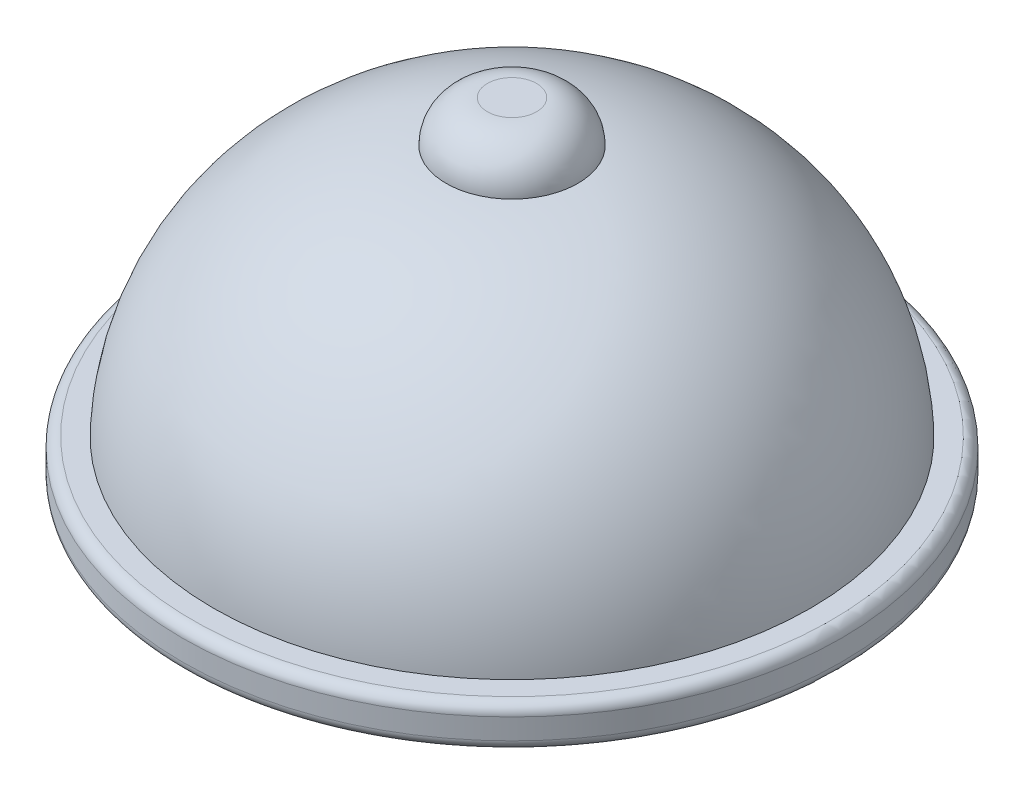
ISO-10303-21;
HEADER;
FILE_DESCRIPTION(('STEP AP214'),'2;1');
FILE_NAME('part.step','',(''),(''),'','','');
FILE_SCHEMA(('AUTOMOTIVE_DESIGN { 1 0 10303 214 1 1 1 1 }'));
ENDSEC;
DATA;
#1=APPLICATION_CONTEXT('core data for automotive mechanical design processes');
#2=APPLICATION_PROTOCOL_DEFINITION('international standard','automotive_design',2000,#1);
#3=PRODUCT_CONTEXT('',#1,'mechanical');
#4=PRODUCT('Part','Part','',(#3));
#5=PRODUCT_RELATED_PRODUCT_CATEGORY('part','',(#4));
#6=PRODUCT_DEFINITION_FORMATION('','',#4);
#7=PRODUCT_DEFINITION_CONTEXT('part definition',#1,'design');
#8=PRODUCT_DEFINITION('design','',#6,#7);
#9=PRODUCT_DEFINITION_SHAPE('','',#8);
#10=(LENGTH_UNIT() NAMED_UNIT(*) SI_UNIT(.MILLI.,.METRE.));
#11=(NAMED_UNIT(*) PLANE_ANGLE_UNIT() SI_UNIT($,.RADIAN.));
#12=(NAMED_UNIT(*) SI_UNIT($,.STERADIAN.) SOLID_ANGLE_UNIT());
#13=UNCERTAINTY_MEASURE_WITH_UNIT(LENGTH_MEASURE(1.E-05),#10,'distance_accuracy_value','');
#14=(GEOMETRIC_REPRESENTATION_CONTEXT(3) GLOBAL_UNCERTAINTY_ASSIGNED_CONTEXT((#13)) GLOBAL_UNIT_ASSIGNED_CONTEXT((#10,
#11,#12)) REPRESENTATION_CONTEXT('',''));
#15=CARTESIAN_POINT('',(0.,0.,0.));
#16=DIRECTION('',(0.,0.,1.));
#17=DIRECTION('',(1.,0.,0.));
#18=AXIS2_PLACEMENT_3D('',#15,#16,#17);
#19=CARTESIAN_POINT('',(0.,44.2057902372174,0.));
#20=DIRECTION('',(0.,-1.,0.));
#21=DIRECTION('',(0.,0.,-1.));
#22=AXIS2_PLACEMENT_3D('',#19,#20,#21);
#23=PLANE('',#22);
#24=CARTESIAN_POINT('',(0.,44.2057902372174,0.));
#25=DIRECTION('',(0.,-1.,0.));
#26=DIRECTION('',(0.,0.,-1.));
#27=AXIS2_PLACEMENT_3D('',#24,#25,#26);
#28=CIRCLE('',#27,15.0893742438228);
#29=CARTESIAN_POINT('',(0.,44.2057902372174,-15.0893742438228));
#30=VERTEX_POINT('',#29);
#31=EDGE_CURVE('E10',#30,#30,#28,.T.);
#32=ORIENTED_EDGE('',*,*,#31,.F.);
#33=EDGE_LOOP('',(#32));
#34=FACE_BOUND('',#33,.T.);
#35=ADVANCED_FACE('F33',(#34),#23,.F.);
#36=CARTESIAN_POINT('',(0.,18.8057902372174,0.));
#37=DIRECTION('',(0.,-1.,0.));
#38=DIRECTION('',(0.,0.,-1.));
#39=AXIS2_PLACEMENT_3D('',#36,#37,#38);
#40=DEGENERATE_TOROIDAL_SURFACE('',#39,15.089374243823,25.4,.T.);
#41=CARTESIAN_POINT('',(0.,18.8057902372172,0.));
#42=DIRECTION('',(0.,-1.,0.));
#43=DIRECTION('',(0.,0.,-1.));
#44=AXIS2_PLACEMENT_3D('',#41,#42,#43);
#45=CIRCLE('',#44,40.489374243823);
#46=CARTESIAN_POINT('',(0.,18.8057902372172,-40.489374243823));
#47=VERTEX_POINT('',#46);
#48=EDGE_CURVE('E39',#47,#47,#45,.T.);
#49=ORIENTED_EDGE('',*,*,#48,.F.);
#50=EDGE_LOOP('',(#49));
#51=FACE_BOUND('',#50,.T.);
#52=ORIENTED_EDGE('',*,*,#31,.T.);
#53=EDGE_LOOP('',(#52));
#54=FACE_BOUND('',#53,.T.);
#55=ADVANCED_FACE('F126',(#51,#54),#40,.T.);
#56=CARTESIAN_POINT('',(0.,-142.850949297738,0.));
#57=DIRECTION('',(0.,-1.,0.));
#58=DIRECTION('',(0.,0.,-1.));
#59=AXIS2_PLACEMENT_3D('',#56,#57,#58);
#60=DEGENERATE_TOROIDAL_SURFACE('',#59,20.5699164867785,162.879360983542,.T.);
#61=CARTESIAN_POINT('',(0.,-135.811771560023,0.));
#62=DIRECTION('',(0.,-1.,0.));
#63=DIRECTION('',(0.,0.,-1.));
#64=AXIS2_PLACEMENT_3D('',#61,#62,#63);
#65=CIRCLE('',#64,183.297099867994);
#66=CARTESIAN_POINT('',(0.,-135.811771560023,-183.297099867994));
#67=VERTEX_POINT('',#66);
#68=EDGE_CURVE('E43',#67,#67,#65,.T.);
#69=ORIENTED_EDGE('',*,*,#68,.F.);
#70=EDGE_LOOP('',(#69));
#71=FACE_BOUND('',#70,.T.);
#72=ORIENTED_EDGE('',*,*,#48,.T.);
#73=EDGE_LOOP('',(#72));
#74=FACE_BOUND('',#73,.T.);
#75=ADVANCED_FACE('F121',(#71,#74),#60,.T.);
#76=CARTESIAN_POINT('',(-183.297099867994,-135.811771560023,0.));
#77=DIRECTION('',(0.,-1.,0.));
#78=DIRECTION('',(0.,0.,-1.));
#79=AXIS2_PLACEMENT_3D('',#76,#77,#78);
#80=PLANE('',#79);
#81=CARTESIAN_POINT('',(0.,-135.811771560023,0.));
#82=DIRECTION('',(0.,-1.,0.));
#83=DIRECTION('',(0.,0.,-1.));
#84=AXIS2_PLACEMENT_3D('',#81,#82,#83);
#85=CIRCLE('',#84,196.040553668275);
#86=CARTESIAN_POINT('',(0.,-135.811771560023,-196.040553668275));
#87=VERTEX_POINT('',#86);
#88=EDGE_CURVE('E47',#87,#87,#85,.T.);
#89=ORIENTED_EDGE('',*,*,#88,.F.);
#90=EDGE_LOOP('',(#89));
#91=FACE_BOUND('',#90,.T.);
#92=ORIENTED_EDGE('',*,*,#68,.T.);
#93=EDGE_LOOP('',(#92));
#94=FACE_BOUND('',#93,.T.);
#95=ADVANCED_FACE('F115',(#91,#94),#80,.F.);
#96=CARTESIAN_POINT('',(0.,-142.161771560023,0.));
#97=DIRECTION('',(0.,-1.,0.));
#98=DIRECTION('',(0.,0.,-1.));
#99=AXIS2_PLACEMENT_3D('',#96,#97,#98);
#100=TOROIDAL_SURFACE('',#99,196.040553668275,6.34999999999999);
#101=CARTESIAN_POINT('',(0.,-142.161771560023,0.));
#102=DIRECTION('',(0.,-1.,0.));
#103=DIRECTION('',(0.,0.,-1.));
#104=AXIS2_PLACEMENT_3D('',#101,#102,#103);
#105=CIRCLE('',#104,202.390553668275);
#106=CARTESIAN_POINT('',(0.,-142.161771560023,-202.390553668275));
#107=VERTEX_POINT('',#106);
#108=EDGE_CURVE('E52',#107,#107,#105,.T.);
#109=ORIENTED_EDGE('',*,*,#108,.F.);
#110=EDGE_LOOP('',(#109));
#111=FACE_BOUND('',#110,.T.);
#112=ORIENTED_EDGE('',*,*,#88,.T.);
#113=EDGE_LOOP('',(#112));
#114=FACE_BOUND('',#113,.T.);
#115=ADVANCED_FACE('F109',(#111,#114),#100,.T.);
#116=CARTESIAN_POINT('',(0.,0.,0.));
#117=DIRECTION('',(0.,-1.,0.));
#118=DIRECTION('',(0.,0.,-1.));
#119=AXIS2_PLACEMENT_3D('',#116,#117,#118);
#120=CYLINDRICAL_SURFACE('',#119,202.390553668275);
#121=CARTESIAN_POINT('',(0.,-154.861771560023,0.));
#122=DIRECTION('',(0.,-1.,0.));
#123=DIRECTION('',(0.,0.,-1.));
#124=AXIS2_PLACEMENT_3D('',#121,#122,#123);
#125=CIRCLE('',#124,202.390553668275);
#126=CARTESIAN_POINT('',(0.,-154.861771560023,-202.390553668275));
#127=VERTEX_POINT('',#126);
#128=EDGE_CURVE('E55',#127,#127,#125,.T.);
#129=ORIENTED_EDGE('',*,*,#128,.F.);
#130=EDGE_LOOP('',(#129));
#131=FACE_BOUND('',#130,.T.);
#132=ORIENTED_EDGE('',*,*,#108,.T.);
#133=EDGE_LOOP('',(#132));
#134=FACE_BOUND('',#133,.T.);
#135=ADVANCED_FACE('F103',(#131,#134),#120,.T.);
#136=CARTESIAN_POINT('',(0.,-154.861771560023,0.));
#137=DIRECTION('',(0.,-1.,0.));
#138=DIRECTION('',(0.,0.,-1.));
#139=AXIS2_PLACEMENT_3D('',#136,#137,#138);
#140=TOROIDAL_SURFACE('',#139,196.040553668275,6.34999999999999);
#141=CARTESIAN_POINT('',(0.,-161.211771560023,0.));
#142=DIRECTION('',(0.,-1.,0.));
#143=DIRECTION('',(0.,0.,-1.));
#144=AXIS2_PLACEMENT_3D('',#141,#142,#143);
#145=CIRCLE('',#144,196.040553668275);
#146=CARTESIAN_POINT('',(0.,-161.211771560023,-196.040553668275));
#147=VERTEX_POINT('',#146);
#148=EDGE_CURVE('E58',#147,#147,#145,.T.);
#149=ORIENTED_EDGE('',*,*,#148,.F.);
#150=EDGE_LOOP('',(#149));
#151=FACE_BOUND('',#150,.T.);
#152=ORIENTED_EDGE('',*,*,#128,.T.);
#153=EDGE_LOOP('',(#152));
#154=FACE_BOUND('',#153,.T.);
#155=ADVANCED_FACE('F97',(#151,#154),#140,.T.);
#156=CARTESIAN_POINT('',(-183.297099867994,-161.211771560023,0.));
#157=DIRECTION('',(0.,1.,0.));
#158=DIRECTION('',(0.,0.,1.));
#159=AXIS2_PLACEMENT_3D('',#156,#157,#158);
#160=PLANE('',#159);
#161=CARTESIAN_POINT('',(0.,-161.211771560023,0.));
#162=DIRECTION('',(0.,-1.,0.));
#163=DIRECTION('',(0.,0.,-1.));
#164=AXIS2_PLACEMENT_3D('',#161,#162,#163);
#165=CIRCLE('',#164,167.526635099375);
#166=CARTESIAN_POINT('',(0.,-161.211771560023,-167.526635099375));
#167=VERTEX_POINT('',#166);
#168=EDGE_CURVE('E61',#167,#167,#165,.T.);
#169=ORIENTED_EDGE('',*,*,#168,.F.);
#170=EDGE_LOOP('',(#169));
#171=FACE_BOUND('',#170,.T.);
#172=ORIENTED_EDGE('',*,*,#148,.T.);
#173=EDGE_LOOP('',(#172));
#174=FACE_BOUND('',#173,.T.);
#175=ADVANCED_FACE('F91',(#171,#174),#160,.F.);
#176=CARTESIAN_POINT('',(0.,-154.861771560023,0.));
#177=DIRECTION('',(0.,-1.,0.));
#178=DIRECTION('',(0.,0.,-1.));
#179=AXIS2_PLACEMENT_3D('',#176,#177,#178);
#180=TOROIDAL_SURFACE('',#179,167.526635099375,6.34999999999999);
#181=CARTESIAN_POINT('',(0.,-154.861771560023,0.));
#182=DIRECTION('',(0.,-1.,0.));
#183=DIRECTION('',(0.,0.,-1.));
#184=AXIS2_PLACEMENT_3D('',#181,#182,#183);
#185=CIRCLE('',#184,161.176635099375);
#186=CARTESIAN_POINT('',(0.,-154.861771560023,-161.176635099375));
#187=VERTEX_POINT('',#186);
#188=EDGE_CURVE('E64',#187,#187,#185,.T.);
#189=ORIENTED_EDGE('',*,*,#188,.F.);
#190=EDGE_LOOP('',(#189));
#191=FACE_BOUND('',#190,.T.);
#192=ORIENTED_EDGE('',*,*,#168,.T.);
#193=EDGE_LOOP('',(#192));
#194=FACE_BOUND('',#193,.T.);
#195=ADVANCED_FACE('F85',(#191,#194),#180,.T.);
#196=CARTESIAN_POINT('',(0.,0.,0.));
#197=DIRECTION('',(0.,-1.,0.));
#198=DIRECTION('',(0.,0.,-1.));
#199=AXIS2_PLACEMENT_3D('',#196,#197,#198);
#200=CYLINDRICAL_SURFACE('',#199,161.176635099375);
#201=CARTESIAN_POINT('',(0.,-135.811771560023,0.));
#202=DIRECTION('',(0.,-1.,0.));
#203=DIRECTION('',(0.,0.,-1.));
#204=AXIS2_PLACEMENT_3D('',#201,#202,#203);
#205=CIRCLE('',#204,161.176635099375);
#206=CARTESIAN_POINT('',(0.,-135.811771560023,-161.176635099375));
#207=VERTEX_POINT('',#206);
#208=EDGE_CURVE('E67',#207,#207,#205,.T.);
#209=ORIENTED_EDGE('',*,*,#208,.F.);
#210=EDGE_LOOP('',(#209));
#211=FACE_BOUND('',#210,.T.);
#212=ORIENTED_EDGE('',*,*,#188,.T.);
#213=EDGE_LOOP('',(#212));
#214=FACE_BOUND('',#213,.T.);
#215=ADVANCED_FACE('F79',(#211,#214),#200,.F.);
#216=CARTESIAN_POINT('',(0.,-135.039614712729,0.));
#217=DIRECTION('',(0.,-1.,0.));
#218=DIRECTION('',(0.,0.,-1.));
#219=AXIS2_PLACEMENT_3D('',#216,#217,#218);
#220=DEGENERATE_TOROIDAL_SURFACE('',#219,25.2860861886678,135.892742666598,.T.);
#221=CARTESIAN_POINT('',(0.,0.,0.));
#222=DIRECTION('',(0.,-1.,0.));
#223=DIRECTION('',(0.,0.,-1.));
#224=AXIS2_PLACEMENT_3D('',#221,#222,#223);
#225=CIRCLE('',#224,40.489374243823);
#226=CARTESIAN_POINT('',(0.,0.,-40.489374243823));
#227=VERTEX_POINT('',#226);
#228=EDGE_CURVE('E70',#227,#227,#225,.T.);
#229=ORIENTED_EDGE('',*,*,#228,.F.);
#230=EDGE_LOOP('',(#229));
#231=FACE_BOUND('',#230,.T.);
#232=ORIENTED_EDGE('',*,*,#208,.T.);
#233=EDGE_LOOP('',(#232));
#234=FACE_BOUND('',#233,.T.);
#235=ADVANCED_FACE('F76',(#231,#234),#220,.F.);
#236=CARTESIAN_POINT('',(0.,0.,0.));
#237=DIRECTION('',(0.,1.,0.));
#238=DIRECTION('',(0.,0.,1.));
#239=AXIS2_PLACEMENT_3D('',#236,#237,#238);
#240=PLANE('',#239);
#241=ORIENTED_EDGE('',*,*,#228,.T.);
#242=EDGE_LOOP('',(#241));
#243=FACE_BOUND('',#242,.T.);
#244=ADVANCED_FACE('F74',(#243),#240,.F.);
#245=CLOSED_SHELL('',(#35,#55,#75,#95,#115,#135,#155,#175,#195,#215,#235,#244));
#246=MANIFOLD_SOLID_BREP('B2',#245);
#247=ADVANCED_BREP_SHAPE_REPRESENTATION('',(#18,#246),#14);
#248=SHAPE_DEFINITION_REPRESENTATION(#9,#247);
ENDSEC;
END-ISO-10303-21;
